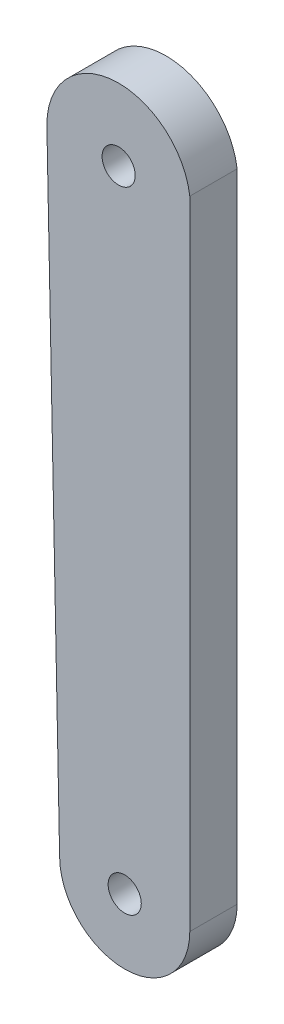
ISO-10303-21;
HEADER;
FILE_DESCRIPTION(('STEP AP214'),'2;1');
FILE_NAME('part.step','',(''),(''),'','','');
FILE_SCHEMA(('AUTOMOTIVE_DESIGN { 1 0 10303 214 1 1 1 1 }'));
ENDSEC;
DATA;
#1=APPLICATION_CONTEXT('core data for automotive mechanical design processes');
#2=APPLICATION_PROTOCOL_DEFINITION('international standard','automotive_design',2000,#1);
#3=PRODUCT_CONTEXT('',#1,'mechanical');
#4=PRODUCT('Part','Part','',(#3));
#5=PRODUCT_RELATED_PRODUCT_CATEGORY('part','',(#4));
#6=PRODUCT_DEFINITION_FORMATION('','',#4);
#7=PRODUCT_DEFINITION_CONTEXT('part definition',#1,'design');
#8=PRODUCT_DEFINITION('design','',#6,#7);
#9=PRODUCT_DEFINITION_SHAPE('','',#8);
#10=(LENGTH_UNIT() NAMED_UNIT(*) SI_UNIT(.MILLI.,.METRE.));
#11=(NAMED_UNIT(*) PLANE_ANGLE_UNIT() SI_UNIT($,.RADIAN.));
#12=(NAMED_UNIT(*) SI_UNIT($,.STERADIAN.) SOLID_ANGLE_UNIT());
#13=UNCERTAINTY_MEASURE_WITH_UNIT(LENGTH_MEASURE(1.E-05),#10,'distance_accuracy_value','');
#14=(GEOMETRIC_REPRESENTATION_CONTEXT(3) GLOBAL_UNCERTAINTY_ASSIGNED_CONTEXT((#13)) GLOBAL_UNIT_ASSIGNED_CONTEXT((#10,
#11,#12)) REPRESENTATION_CONTEXT('',''));
#15=CARTESIAN_POINT('',(0.,0.,0.));
#16=DIRECTION('',(0.,0.,1.));
#17=DIRECTION('',(1.,0.,0.));
#18=AXIS2_PLACEMENT_3D('',#15,#16,#17);
#19=CARTESIAN_POINT('',(-0.000688459381449578,0.,4.));
#20=DIRECTION('',(-1.,0.,0.));
#21=DIRECTION('',(0.,-1.,0.));
#22=AXIS2_PLACEMENT_3D('',#19,#20,#21);
#23=PLANE('',#22);
#24=DIRECTION('',(0.,1.,0.));
#25=VECTOR('',#24,1.);
#26=CARTESIAN_POINT('',(-0.000688459381449578,0.,0.));
#27=LINE('',#26,#25);
#28=CARTESIAN_POINT('',(-0.000688459381543646,-8.00668270422263,0.));
#29=VERTEX_POINT('',#28);
#30=CARTESIAN_POINT('',(-0.00068845938091134,45.812285406667,0.));
#31=VERTEX_POINT('',#30);
#32=EDGE_CURVE('E107',#29,#31,#27,.T.);
#33=ORIENTED_EDGE('',*,*,#32,.T.);
#34=DIRECTION('',(0.,0.,-1.));
#35=VECTOR('',#34,1.);
#36=CARTESIAN_POINT('',(-0.00068845938091134,45.812285406667,4.));
#37=LINE('',#36,#35);
#38=CARTESIAN_POINT('',(-0.00068845938091134,45.812285406667,4.));
#39=VERTEX_POINT('',#38);
#40=EDGE_CURVE('E11',#39,#31,#37,.T.);
#41=ORIENTED_EDGE('',*,*,#40,.F.);
#42=DIRECTION('',(0.,1.,0.));
#43=VECTOR('',#42,1.);
#44=CARTESIAN_POINT('',(-0.000688459381449578,0.,4.));
#45=LINE('',#44,#43);
#46=CARTESIAN_POINT('',(-0.000688459381543646,-8.00668270422263,4.));
#47=VERTEX_POINT('',#46);
#48=EDGE_CURVE('E86',#47,#39,#45,.T.);
#49=ORIENTED_EDGE('',*,*,#48,.F.);
#50=DIRECTION('',(0.,0.,-1.));
#51=VECTOR('',#50,1.);
#52=CARTESIAN_POINT('',(-0.000688459381543646,-8.00668270422263,4.));
#53=LINE('',#52,#51);
#54=EDGE_CURVE('E97',#47,#29,#53,.T.);
#55=ORIENTED_EDGE('',*,*,#54,.T.);
#56=EDGE_LOOP('',(#33,#41,#49,#55));
#57=FACE_BOUND('',#56,.T.);
#58=ADVANCED_FACE('F38',(#57),#23,.F.);
#59=CARTESIAN_POINT('',(-6.01275635098238,45.0160917207258,4.));
#60=DIRECTION('',(0.,0.,-1.));
#61=DIRECTION('',(-1.,0.,0.));
#62=AXIS2_PLACEMENT_3D('',#59,#60,#61);
#63=CYLINDRICAL_SURFACE('',#62,6.06455973000167);
#64=CARTESIAN_POINT('',(-6.01275635098238,45.0160917207258,0.));
#65=DIRECTION('',(0.,0.,1.));
#66=DIRECTION('',(1.,0.,0.));
#67=AXIS2_PLACEMENT_3D('',#64,#65,#66);
#68=CIRCLE('',#67,6.06455973000167);
#69=CARTESIAN_POINT('',(-12.077316080984,45.0160917207258,0.));
#70=VERTEX_POINT('',#69);
#71=EDGE_CURVE('E91',#31,#70,#68,.T.);
#72=ORIENTED_EDGE('',*,*,#71,.T.);
#73=DIRECTION('',(0.,0.,-1.));
#74=VECTOR('',#73,1.);
#75=CARTESIAN_POINT('',(-12.077316080984,45.0160917207258,4.));
#76=LINE('',#75,#74);
#77=CARTESIAN_POINT('',(-12.077316080984,45.0160917207258,4.));
#78=VERTEX_POINT('',#77);
#79=EDGE_CURVE('E47',#78,#70,#76,.T.);
#80=ORIENTED_EDGE('',*,*,#79,.F.);
#81=CARTESIAN_POINT('',(-6.01275635098238,45.0160917207258,4.));
#82=DIRECTION('',(0.,0.,1.));
#83=DIRECTION('',(1.,0.,0.));
#84=AXIS2_PLACEMENT_3D('',#81,#82,#83);
#85=CIRCLE('',#84,6.06455973000167);
#86=EDGE_CURVE('E81',#39,#78,#85,.T.);
#87=ORIENTED_EDGE('',*,*,#86,.F.);
#88=ORIENTED_EDGE('',*,*,#40,.T.);
#89=EDGE_LOOP('',(#72,#80,#87,#88));
#90=FACE_BOUND('',#89,.T.);
#91=ADVANCED_FACE('F90',(#90),#63,.T.);
#92=CARTESIAN_POINT('',(-11.1586635391713,-0.226576702496876,4.));
#93=DIRECTION('',(-0.999793917138653,-0.0203008190117483,0.));
#94=DIRECTION('',(0.0203008190117483,-0.999793917138653,0.));
#95=AXIS2_PLACEMENT_3D('',#92,#93,#94);
#96=PLANE('',#95);
#97=DIRECTION('',(-0.0203008190117483,0.999793917138653,0.));
#98=VECTOR('',#97,1.);
#99=CARTESIAN_POINT('',(-11.1586635391713,-0.226576702496876,0.));
#100=LINE('',#99,#98);
#101=CARTESIAN_POINT('',(-11.0006884593815,-8.00668270422256,0.));
#102=VERTEX_POINT('',#101);
#103=EDGE_CURVE('E111',#102,#70,#100,.T.);
#104=ORIENTED_EDGE('',*,*,#103,.F.);
#105=DIRECTION('',(0.,0.,-1.));
#106=VECTOR('',#105,1.);
#107=CARTESIAN_POINT('',(-11.0006884593815,-8.00668270422256,4.));
#108=LINE('',#107,#106);
#109=CARTESIAN_POINT('',(-11.0006884593815,-8.00668270422256,4.));
#110=VERTEX_POINT('',#109);
#111=EDGE_CURVE('E71',#110,#102,#108,.T.);
#112=ORIENTED_EDGE('',*,*,#111,.F.);
#113=DIRECTION('',(-0.0203008190117483,0.999793917138653,0.));
#114=VECTOR('',#113,1.);
#115=CARTESIAN_POINT('',(-11.1586635391713,-0.226576702496876,4.));
#116=LINE('',#115,#114);
#117=EDGE_CURVE('E84',#110,#78,#116,.T.);
#118=ORIENTED_EDGE('',*,*,#117,.T.);
#119=ORIENTED_EDGE('',*,*,#79,.T.);
#120=EDGE_LOOP('',(#104,#112,#118,#119));
#121=FACE_BOUND('',#120,.T.);
#122=ADVANCED_FACE('F95',(#121),#96,.T.);
#123=CARTESIAN_POINT('',(-6.01275635098238,45.0160917207258,4.));
#124=DIRECTION('',(0.,0.,-1.));
#125=DIRECTION('',(-1.,0.,0.));
#126=AXIS2_PLACEMENT_3D('',#123,#124,#125);
#127=CYLINDRICAL_SURFACE('',#126,1.4);
#128=CARTESIAN_POINT('',(-6.01275635098238,45.0160917207258,4.));
#129=DIRECTION('',(0.,0.,1.));
#130=DIRECTION('',(1.,0.,0.));
#131=AXIS2_PLACEMENT_3D('',#128,#129,#130);
#132=CIRCLE('',#131,1.4);
#133=CARTESIAN_POINT('',(-4.61275635098238,45.0160917207258,4.));
#134=VERTEX_POINT('',#133);
#135=EDGE_CURVE('E149',#134,#134,#132,.T.);
#136=ORIENTED_EDGE('',*,*,#135,.T.);
#137=EDGE_LOOP('',(#136));
#138=FACE_BOUND('',#137,.T.);
#139=CARTESIAN_POINT('',(-6.01275635098238,45.0160917207258,0.));
#140=DIRECTION('',(0.,0.,1.));
#141=DIRECTION('',(1.,0.,0.));
#142=AXIS2_PLACEMENT_3D('',#139,#140,#141);
#143=CIRCLE('',#142,1.4);
#144=CARTESIAN_POINT('',(-4.61275635098238,45.0160917207258,0.));
#145=VERTEX_POINT('',#144);
#146=EDGE_CURVE('E104',#145,#145,#143,.T.);
#147=ORIENTED_EDGE('',*,*,#146,.F.);
#148=EDGE_LOOP('',(#147));
#149=FACE_BOUND('',#148,.T.);
#150=ADVANCED_FACE('F138',(#138,#149),#127,.F.);
#151=CARTESIAN_POINT('',(-5.50068845938154,-8.00668270422256,4.));
#152=DIRECTION('',(0.,0.,-1.));
#153=DIRECTION('',(-1.,0.,0.));
#154=AXIS2_PLACEMENT_3D('',#151,#152,#153);
#155=CYLINDRICAL_SURFACE('',#154,1.40000000000048);
#156=CARTESIAN_POINT('',(-5.50068845938154,-8.00668270422256,4.));
#157=DIRECTION('',(0.,0.,1.));
#158=DIRECTION('',(1.,0.,0.));
#159=AXIS2_PLACEMENT_3D('',#156,#157,#158);
#160=CIRCLE('',#159,1.40000000000048);
#161=CARTESIAN_POINT('',(-4.10068845938106,-8.00668270422256,4.));
#162=VERTEX_POINT('',#161);
#163=EDGE_CURVE('E114',#162,#162,#160,.T.);
#164=ORIENTED_EDGE('',*,*,#163,.T.);
#165=EDGE_LOOP('',(#164));
#166=FACE_BOUND('',#165,.T.);
#167=CARTESIAN_POINT('',(-5.50068845938154,-8.00668270422256,0.));
#168=DIRECTION('',(0.,0.,1.));
#169=DIRECTION('',(1.,0.,0.));
#170=AXIS2_PLACEMENT_3D('',#167,#168,#169);
#171=CIRCLE('',#170,1.40000000000048);
#172=CARTESIAN_POINT('',(-4.10068845938106,-8.00668270422256,0.));
#173=VERTEX_POINT('',#172);
#174=EDGE_CURVE('E101',#173,#173,#171,.T.);
#175=ORIENTED_EDGE('',*,*,#174,.F.);
#176=EDGE_LOOP('',(#175));
#177=FACE_BOUND('',#176,.T.);
#178=ADVANCED_FACE('F40',(#166,#177),#155,.F.);
#179=CARTESIAN_POINT('',(-5.50068845938154,-8.00668270422256,4.));
#180=DIRECTION('',(0.,0.,-1.));
#181=DIRECTION('',(-1.,0.,0.));
#182=AXIS2_PLACEMENT_3D('',#179,#180,#181);
#183=CYLINDRICAL_SURFACE('',#182,5.5);
#184=CARTESIAN_POINT('',(-5.50068845938154,-8.00668270422256,0.));
#185=DIRECTION('',(0.,0.,1.));
#186=DIRECTION('',(1.,0.,0.));
#187=AXIS2_PLACEMENT_3D('',#184,#185,#186);
#188=CIRCLE('',#187,5.5);
#189=EDGE_CURVE('E74',#102,#29,#188,.T.);
#190=ORIENTED_EDGE('',*,*,#189,.T.);
#191=ORIENTED_EDGE('',*,*,#54,.F.);
#192=CARTESIAN_POINT('',(-5.50068845938154,-8.00668270422256,4.));
#193=DIRECTION('',(0.,0.,1.));
#194=DIRECTION('',(1.,0.,0.));
#195=AXIS2_PLACEMENT_3D('',#192,#193,#194);
#196=CIRCLE('',#195,5.5);
#197=EDGE_CURVE('E55',#110,#47,#196,.T.);
#198=ORIENTED_EDGE('',*,*,#197,.F.);
#199=ORIENTED_EDGE('',*,*,#111,.T.);
#200=EDGE_LOOP('',(#190,#191,#198,#199));
#201=FACE_BOUND('',#200,.T.);
#202=ADVANCED_FACE('F126',(#201),#183,.T.);
#203=CARTESIAN_POINT('',(0.,0.,4.));
#204=DIRECTION('',(0.,0.,1.));
#205=DIRECTION('',(1.,0.,0.));
#206=AXIS2_PLACEMENT_3D('',#203,#204,#205);
#207=PLANE('',#206);
#208=ORIENTED_EDGE('',*,*,#163,.F.);
#209=EDGE_LOOP('',(#208));
#210=FACE_BOUND('',#209,.T.);
#211=ORIENTED_EDGE('',*,*,#135,.F.);
#212=EDGE_LOOP('',(#211));
#213=FACE_BOUND('',#212,.T.);
#214=ORIENTED_EDGE('',*,*,#48,.T.);
#215=ORIENTED_EDGE('',*,*,#86,.T.);
#216=ORIENTED_EDGE('',*,*,#117,.F.);
#217=ORIENTED_EDGE('',*,*,#197,.T.);
#218=EDGE_LOOP('',(#214,#215,#216,#217));
#219=FACE_BOUND('',#218,.T.);
#220=ADVANCED_FACE('F82',(#210,#213,#219),#207,.T.);
#221=CARTESIAN_POINT('',(0.,0.,0.));
#222=DIRECTION('',(0.,0.,1.));
#223=DIRECTION('',(1.,0.,0.));
#224=AXIS2_PLACEMENT_3D('',#221,#222,#223);
#225=PLANE('',#224);
#226=ORIENTED_EDGE('',*,*,#174,.T.);
#227=EDGE_LOOP('',(#226));
#228=FACE_BOUND('',#227,.T.);
#229=ORIENTED_EDGE('',*,*,#146,.T.);
#230=EDGE_LOOP('',(#229));
#231=FACE_BOUND('',#230,.T.);
#232=ORIENTED_EDGE('',*,*,#32,.F.);
#233=ORIENTED_EDGE('',*,*,#189,.F.);
#234=ORIENTED_EDGE('',*,*,#103,.T.);
#235=ORIENTED_EDGE('',*,*,#71,.F.);
#236=EDGE_LOOP('',(#232,#233,#234,#235));
#237=FACE_BOUND('',#236,.T.);
#238=ADVANCED_FACE('F119',(#228,#231,#237),#225,.F.);
#239=CLOSED_SHELL('',(#58,#91,#122,#150,#178,#202,#220,#238));
#240=MANIFOLD_SOLID_BREP('B2',#239);
#241=ADVANCED_BREP_SHAPE_REPRESENTATION('',(#18,#240),#14);
#242=SHAPE_DEFINITION_REPRESENTATION(#9,#241);
ENDSEC;
END-ISO-10303-21;
